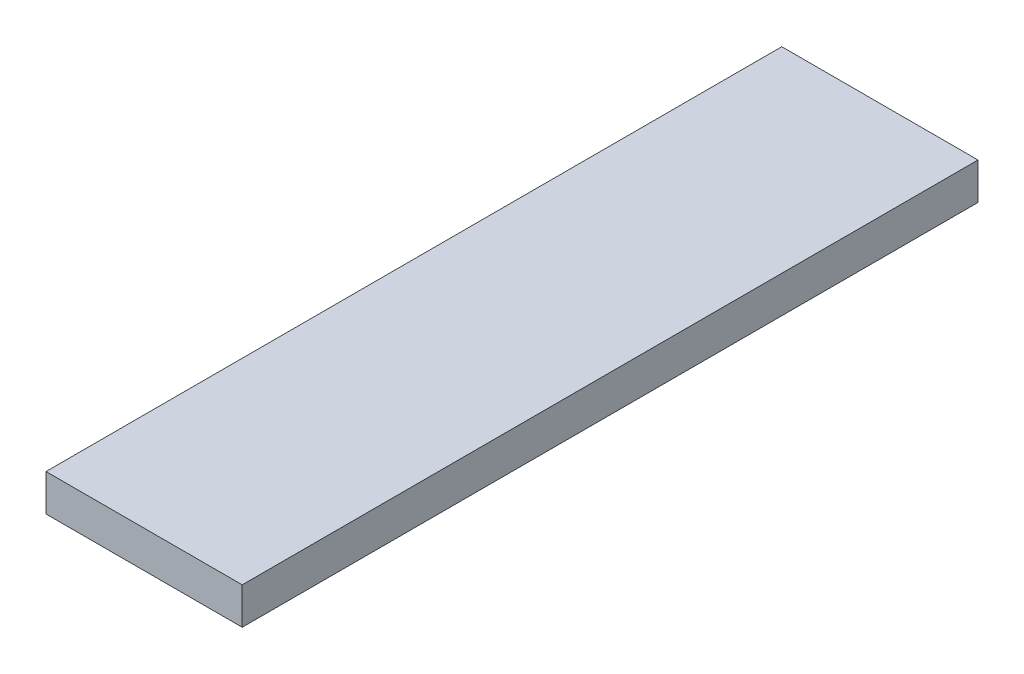
ISO-10303-21;
HEADER;
FILE_DESCRIPTION(('STEP AP214'),'2;1');
FILE_NAME('part.step','',(''),(''),'','','');
FILE_SCHEMA(('AUTOMOTIVE_DESIGN { 1 0 10303 214 1 1 1 1 }'));
ENDSEC;
DATA;
#1=APPLICATION_CONTEXT('core data for automotive mechanical design processes');
#2=APPLICATION_PROTOCOL_DEFINITION('international standard','automotive_design',2000,#1);
#3=PRODUCT_CONTEXT('',#1,'mechanical');
#4=PRODUCT('Part','Part','',(#3));
#5=PRODUCT_RELATED_PRODUCT_CATEGORY('part','',(#4));
#6=PRODUCT_DEFINITION_FORMATION('','',#4);
#7=PRODUCT_DEFINITION_CONTEXT('part definition',#1,'design');
#8=PRODUCT_DEFINITION('design','',#6,#7);
#9=PRODUCT_DEFINITION_SHAPE('','',#8);
#10=(LENGTH_UNIT() NAMED_UNIT(*) SI_UNIT(.MILLI.,.METRE.));
#11=(NAMED_UNIT(*) PLANE_ANGLE_UNIT() SI_UNIT($,.RADIAN.));
#12=(NAMED_UNIT(*) SI_UNIT($,.STERADIAN.) SOLID_ANGLE_UNIT());
#13=UNCERTAINTY_MEASURE_WITH_UNIT(LENGTH_MEASURE(1.E-05),#10,'distance_accuracy_value','');
#14=(GEOMETRIC_REPRESENTATION_CONTEXT(3) GLOBAL_UNCERTAINTY_ASSIGNED_CONTEXT((#13)) GLOBAL_UNIT_ASSIGNED_CONTEXT((#10,
#11,#12)) REPRESENTATION_CONTEXT('',''));
#15=CARTESIAN_POINT('',(0.,0.,0.));
#16=DIRECTION('',(0.,0.,1.));
#17=DIRECTION('',(1.,0.,0.));
#18=AXIS2_PLACEMENT_3D('',#15,#16,#17);
#19=CARTESIAN_POINT('',(7.99999999999999,3.,-30.));
#20=DIRECTION('',(-1.,0.,0.));
#21=DIRECTION('',(0.,0.,1.));
#22=AXIS2_PLACEMENT_3D('',#19,#20,#21);
#23=PLANE('',#22);
#24=DIRECTION('',(0.,0.,-1.));
#25=VECTOR('',#24,1.);
#26=CARTESIAN_POINT('',(7.99999999999999,0.,-30.));
#27=LINE('',#26,#25);
#28=CARTESIAN_POINT('',(8.,0.,30.));
#29=VERTEX_POINT('',#28);
#30=CARTESIAN_POINT('',(7.99999999999999,0.,-30.));
#31=VERTEX_POINT('',#30);
#32=EDGE_CURVE('E97',#29,#31,#27,.T.);
#33=ORIENTED_EDGE('',*,*,#32,.T.);
#34=DIRECTION('',(0.,-1.,0.));
#35=VECTOR('',#34,1.);
#36=CARTESIAN_POINT('',(7.99999999999999,3.,-30.));
#37=LINE('',#36,#35);
#38=CARTESIAN_POINT('',(7.99999999999999,3.,-30.));
#39=VERTEX_POINT('',#38);
#40=EDGE_CURVE('E11',#39,#31,#37,.T.);
#41=ORIENTED_EDGE('',*,*,#40,.F.);
#42=DIRECTION('',(0.,0.,-1.));
#43=VECTOR('',#42,1.);
#44=CARTESIAN_POINT('',(7.99999999999999,3.,-30.));
#45=LINE('',#44,#43);
#46=CARTESIAN_POINT('',(8.,3.,30.));
#47=VERTEX_POINT('',#46);
#48=EDGE_CURVE('E85',#47,#39,#45,.T.);
#49=ORIENTED_EDGE('',*,*,#48,.F.);
#50=DIRECTION('',(0.,-1.,0.));
#51=VECTOR('',#50,1.);
#52=CARTESIAN_POINT('',(8.,3.,30.));
#53=LINE('',#52,#51);
#54=EDGE_CURVE('E93',#47,#29,#53,.T.);
#55=ORIENTED_EDGE('',*,*,#54,.T.);
#56=EDGE_LOOP('',(#33,#41,#49,#55));
#57=FACE_BOUND('',#56,.T.);
#58=ADVANCED_FACE('F34',(#57),#23,.F.);
#59=CARTESIAN_POINT('',(-8.00000000000001,3.,-30.));
#60=DIRECTION('',(0.,0.,1.));
#61=DIRECTION('',(1.,0.,0.));
#62=AXIS2_PLACEMENT_3D('',#59,#60,#61);
#63=PLANE('',#62);
#64=DIRECTION('',(-1.,0.,0.));
#65=VECTOR('',#64,1.);
#66=CARTESIAN_POINT('',(-8.00000000000001,0.,-30.));
#67=LINE('',#66,#65);
#68=CARTESIAN_POINT('',(-8.00000000000001,0.,-30.));
#69=VERTEX_POINT('',#68);
#70=EDGE_CURVE('E89',#31,#69,#67,.T.);
#71=ORIENTED_EDGE('',*,*,#70,.T.);
#72=DIRECTION('',(0.,-1.,0.));
#73=VECTOR('',#72,1.);
#74=CARTESIAN_POINT('',(-8.00000000000001,3.,-30.));
#75=LINE('',#74,#73);
#76=CARTESIAN_POINT('',(-8.00000000000001,3.,-30.));
#77=VERTEX_POINT('',#76);
#78=EDGE_CURVE('E42',#77,#69,#75,.T.);
#79=ORIENTED_EDGE('',*,*,#78,.F.);
#80=DIRECTION('',(-1.,0.,0.));
#81=VECTOR('',#80,1.);
#82=CARTESIAN_POINT('',(-8.00000000000001,3.,-30.));
#83=LINE('',#82,#81);
#84=EDGE_CURVE('E80',#39,#77,#83,.T.);
#85=ORIENTED_EDGE('',*,*,#84,.F.);
#86=ORIENTED_EDGE('',*,*,#40,.T.);
#87=EDGE_LOOP('',(#71,#79,#85,#86));
#88=FACE_BOUND('',#87,.T.);
#89=ADVANCED_FACE('F88',(#88),#63,.F.);
#90=CARTESIAN_POINT('',(-8.00000000000001,3.,-30.));
#91=DIRECTION('',(1.,0.,0.));
#92=DIRECTION('',(0.,0.,-1.));
#93=AXIS2_PLACEMENT_3D('',#90,#91,#92);
#94=PLANE('',#93);
#95=DIRECTION('',(0.,0.,1.));
#96=VECTOR('',#95,1.);
#97=CARTESIAN_POINT('',(-8.00000000000001,0.,-30.));
#98=LINE('',#97,#96);
#99=CARTESIAN_POINT('',(-8.,0.,30.));
#100=VERTEX_POINT('',#99);
#101=EDGE_CURVE('E67',#69,#100,#98,.T.);
#102=ORIENTED_EDGE('',*,*,#101,.T.);
#103=DIRECTION('',(0.,-1.,0.));
#104=VECTOR('',#103,1.);
#105=CARTESIAN_POINT('',(-8.,3.,30.));
#106=LINE('',#105,#104);
#107=CARTESIAN_POINT('',(-8.,3.,30.));
#108=VERTEX_POINT('',#107);
#109=EDGE_CURVE('E90',#108,#100,#106,.T.);
#110=ORIENTED_EDGE('',*,*,#109,.F.);
#111=DIRECTION('',(0.,0.,1.));
#112=VECTOR('',#111,1.);
#113=CARTESIAN_POINT('',(-8.00000000000001,3.,-30.));
#114=LINE('',#113,#112);
#115=EDGE_CURVE('E83',#77,#108,#114,.T.);
#116=ORIENTED_EDGE('',*,*,#115,.F.);
#117=ORIENTED_EDGE('',*,*,#78,.T.);
#118=EDGE_LOOP('',(#102,#110,#116,#117));
#119=FACE_BOUND('',#118,.T.);
#120=ADVANCED_FACE('F91',(#119),#94,.F.);
#121=CARTESIAN_POINT('',(-8.,3.,30.));
#122=DIRECTION('',(0.,0.,-1.));
#123=DIRECTION('',(-1.,0.,0.));
#124=AXIS2_PLACEMENT_3D('',#121,#122,#123);
#125=PLANE('',#124);
#126=DIRECTION('',(1.,0.,0.));
#127=VECTOR('',#126,1.);
#128=CARTESIAN_POINT('',(-8.,0.,30.));
#129=LINE('',#128,#127);
#130=EDGE_CURVE('E73',#100,#29,#129,.T.);
#131=ORIENTED_EDGE('',*,*,#130,.T.);
#132=ORIENTED_EDGE('',*,*,#54,.F.);
#133=DIRECTION('',(1.,0.,0.));
#134=VECTOR('',#133,1.);
#135=CARTESIAN_POINT('',(-8.,3.,30.));
#136=LINE('',#135,#134);
#137=EDGE_CURVE('E50',#108,#47,#136,.T.);
#138=ORIENTED_EDGE('',*,*,#137,.F.);
#139=ORIENTED_EDGE('',*,*,#109,.T.);
#140=EDGE_LOOP('',(#131,#132,#138,#139));
#141=FACE_BOUND('',#140,.T.);
#142=ADVANCED_FACE('F104',(#141),#125,.F.);
#143=CARTESIAN_POINT('',(0.,3.,0.));
#144=DIRECTION('',(0.,1.,0.));
#145=DIRECTION('',(0.,0.,1.));
#146=AXIS2_PLACEMENT_3D('',#143,#144,#145);
#147=PLANE('',#146);
#148=ORIENTED_EDGE('',*,*,#48,.T.);
#149=ORIENTED_EDGE('',*,*,#84,.T.);
#150=ORIENTED_EDGE('',*,*,#115,.T.);
#151=ORIENTED_EDGE('',*,*,#137,.T.);
#152=EDGE_LOOP('',(#148,#149,#150,#151));
#153=FACE_BOUND('',#152,.T.);
#154=ADVANCED_FACE('F81',(#153),#147,.T.);
#155=CARTESIAN_POINT('',(0.,0.,0.));
#156=DIRECTION('',(0.,1.,0.));
#157=DIRECTION('',(0.,0.,1.));
#158=AXIS2_PLACEMENT_3D('',#155,#156,#157);
#159=PLANE('',#158);
#160=ORIENTED_EDGE('',*,*,#32,.F.);
#161=ORIENTED_EDGE('',*,*,#130,.F.);
#162=ORIENTED_EDGE('',*,*,#101,.F.);
#163=ORIENTED_EDGE('',*,*,#70,.F.);
#164=EDGE_LOOP('',(#160,#161,#162,#163));
#165=FACE_BOUND('',#164,.T.);
#166=ADVANCED_FACE('F107',(#165),#159,.F.);
#167=CLOSED_SHELL('',(#58,#89,#120,#142,#154,#166));
#168=MANIFOLD_SOLID_BREP('B2',#167);
#169=ADVANCED_BREP_SHAPE_REPRESENTATION('',(#18,#168),#14);
#170=SHAPE_DEFINITION_REPRESENTATION(#9,#169);
ENDSEC;
END-ISO-10303-21;
